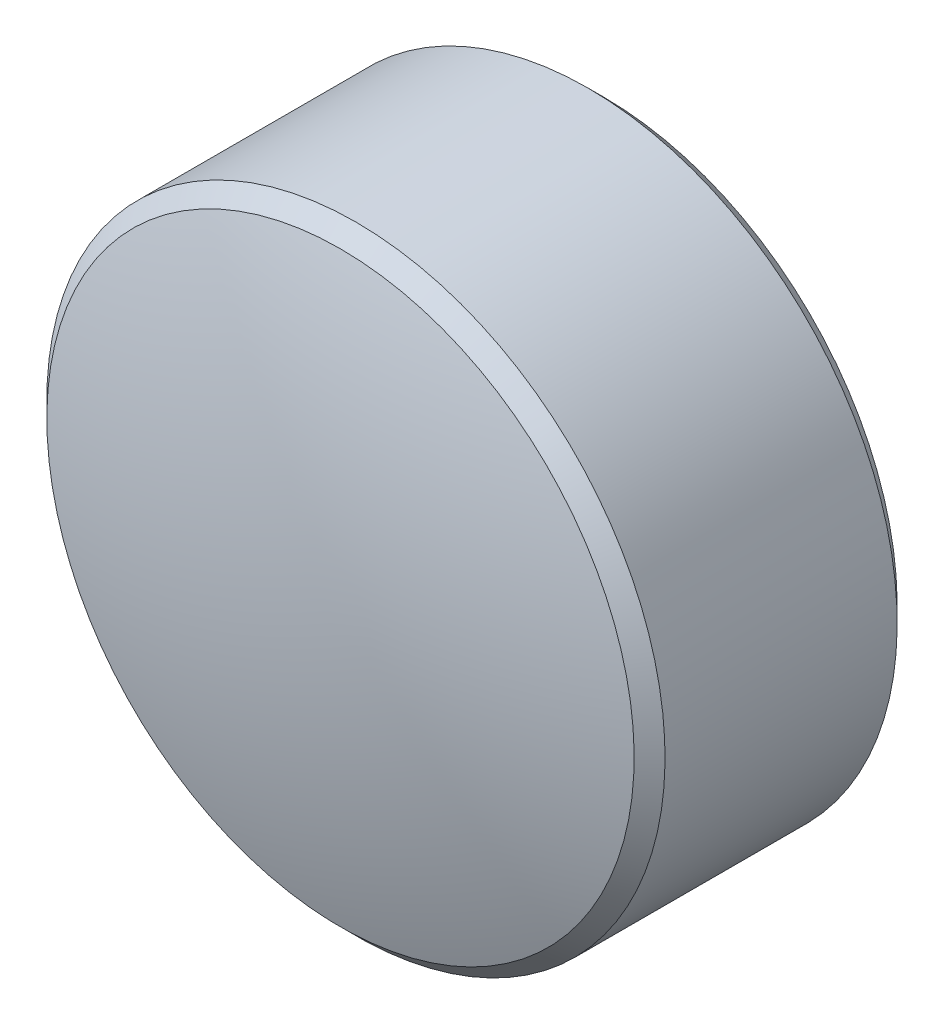
ISO-10303-21;
HEADER;
FILE_DESCRIPTION(('STEP AP214'),'2;1');
FILE_NAME('part.step','',(''),(''),'','','');
FILE_SCHEMA(('AUTOMOTIVE_DESIGN { 1 0 10303 214 1 1 1 1 }'));
ENDSEC;
DATA;
#1=APPLICATION_CONTEXT('core data for automotive mechanical design processes');
#2=APPLICATION_PROTOCOL_DEFINITION('international standard','automotive_design',2000,#1);
#3=PRODUCT_CONTEXT('',#1,'mechanical');
#4=PRODUCT('Part','Part','',(#3));
#5=PRODUCT_RELATED_PRODUCT_CATEGORY('part','',(#4));
#6=PRODUCT_DEFINITION_FORMATION('','',#4);
#7=PRODUCT_DEFINITION_CONTEXT('part definition',#1,'design');
#8=PRODUCT_DEFINITION('design','',#6,#7);
#9=PRODUCT_DEFINITION_SHAPE('','',#8);
#10=(LENGTH_UNIT() NAMED_UNIT(*) SI_UNIT(.MILLI.,.METRE.));
#11=(NAMED_UNIT(*) PLANE_ANGLE_UNIT() SI_UNIT($,.RADIAN.));
#12=(NAMED_UNIT(*) SI_UNIT($,.STERADIAN.) SOLID_ANGLE_UNIT());
#13=UNCERTAINTY_MEASURE_WITH_UNIT(LENGTH_MEASURE(1.E-05),#10,'distance_accuracy_value','');
#14=(GEOMETRIC_REPRESENTATION_CONTEXT(3) GLOBAL_UNCERTAINTY_ASSIGNED_CONTEXT((#13)) GLOBAL_UNIT_ASSIGNED_CONTEXT((#10,
#11,#12)) REPRESENTATION_CONTEXT('',''));
#15=CARTESIAN_POINT('',(0.,0.,0.));
#16=DIRECTION('',(0.,0.,1.));
#17=DIRECTION('',(1.,0.,0.));
#18=AXIS2_PLACEMENT_3D('',#15,#16,#17);
#19=CARTESIAN_POINT('',(0.630043255292849,1.16885341370505,1.0116272400795));
#20=DIRECTION('',(0.,0.,-1.));
#21=DIRECTION('',(0.,1.,0.));
#22=AXIS2_PLACEMENT_3D('',#19,#20,#21);
#23=PLANE('',#22);
#24=CARTESIAN_POINT('',(0.630043255292849,1.16885341370505,1.0116272400795));
#25=DIRECTION('',(0.,0.,-1.));
#26=DIRECTION('',(0.,1.,0.));
#27=AXIS2_PLACEMENT_3D('',#24,#25,#26);
#28=CIRCLE('',#27,0.949999999999999);
#29=CARTESIAN_POINT('',(0.630043255292849,2.11885341370505,1.0116272400795));
#30=VERTEX_POINT('',#29);
#31=EDGE_CURVE('E20',#30,#30,#28,.T.);
#32=ORIENTED_EDGE('',*,*,#31,.T.);
#33=EDGE_LOOP('',(#32));
#34=FACE_BOUND('',#33,.T.);
#35=ADVANCED_FACE('F13',(#34),#23,.T.);
#36=CARTESIAN_POINT('',(0.630043255292849,1.16885341370505,1.0116272400795));
#37=DIRECTION('',(0.,0.,-1.));
#38=DIRECTION('',(0.,1.,0.));
#39=AXIS2_PLACEMENT_3D('',#36,#37,#38);
#40=CYLINDRICAL_SURFACE('',#39,1.);
#41=CARTESIAN_POINT('',(0.630043255292849,1.16885341370505,1.0616272400795));
#42=DIRECTION('',(0.,0.,-1.));
#43=DIRECTION('',(0.,1.,0.));
#44=AXIS2_PLACEMENT_3D('',#41,#42,#43);
#45=CIRCLE('',#44,1.);
#46=CARTESIAN_POINT('',(0.630043255292849,2.16885341370505,1.0616272400795));
#47=VERTEX_POINT('',#46);
#48=EDGE_CURVE('E9',#47,#47,#45,.F.);
#49=ORIENTED_EDGE('',*,*,#48,.T.);
#50=EDGE_LOOP('',(#49));
#51=FACE_BOUND('',#50,.T.);
#52=CARTESIAN_POINT('',(0.630043255292849,1.16885341370505,1.81252510416626));
#53=DIRECTION('',(0.,0.,-1.));
#54=DIRECTION('',(0.,1.,0.));
#55=AXIS2_PLACEMENT_3D('',#52,#53,#54);
#56=CIRCLE('',#55,1.);
#57=CARTESIAN_POINT('',(0.630043255292849,2.16885341370505,1.81252510416626));
#58=VERTEX_POINT('',#57);
#59=EDGE_CURVE('E24',#58,#58,#56,.T.);
#60=ORIENTED_EDGE('',*,*,#59,.T.);
#61=EDGE_LOOP('',(#60));
#62=FACE_BOUND('',#61,.T.);
#63=ADVANCED_FACE('F46',(#51,#62),#40,.T.);
#64=CARTESIAN_POINT('',(0.630043255292849,1.16885341370505,1.81252510416626));
#65=DIRECTION('',(0.,0.,-1.));
#66=DIRECTION('',(0.,1.,0.));
#67=AXIS2_PLACEMENT_3D('',#64,#65,#66);
#68=CONICAL_SURFACE('',#67,1.,0.785398163397448);
#69=CARTESIAN_POINT('',(0.630043255292849,1.16885341370505,1.86252510416626));
#70=DIRECTION('',(0.,0.,-1.));
#71=DIRECTION('',(0.,1.,0.));
#72=AXIS2_PLACEMENT_3D('',#69,#70,#71);
#73=CIRCLE('',#72,0.95);
#74=CARTESIAN_POINT('',(0.630043255292849,2.11885341370505,1.86252510416626));
#75=VERTEX_POINT('',#74);
#76=EDGE_CURVE('E28',#75,#75,#73,.T.);
#77=ORIENTED_EDGE('',*,*,#76,.T.);
#78=EDGE_LOOP('',(#77));
#79=FACE_BOUND('',#78,.T.);
#80=ORIENTED_EDGE('',*,*,#59,.F.);
#81=EDGE_LOOP('',(#80));
#82=FACE_BOUND('',#81,.T.);
#83=ADVANCED_FACE('F34',(#79,#82),#68,.T.);
#84=CARTESIAN_POINT('',(0.630043255292849,1.16885341370505,-1.0893727599205));
#85=DIRECTION('',(0.,0.,-1.));
#86=DIRECTION('',(0.,1.,0.));
#87=AXIS2_PLACEMENT_3D('',#84,#85,#86);
#88=SPHERICAL_SURFACE('',#87,3.101);
#89=ORIENTED_EDGE('',*,*,#76,.F.);
#90=EDGE_LOOP('',(#89));
#91=FACE_BOUND('',#90,.T.);
#92=ADVANCED_FACE('F37',(#91),#88,.T.);
#93=CARTESIAN_POINT('',(0.630043255292849,1.16885341370505,1.0116272400795));
#94=DIRECTION('',(0.,0.,1.));
#95=DIRECTION('',(0.,-1.,0.));
#96=AXIS2_PLACEMENT_3D('',#93,#94,#95);
#97=CONICAL_SURFACE('',#96,0.949999999999999,0.78539816339745);
#98=ORIENTED_EDGE('',*,*,#48,.F.);
#99=EDGE_LOOP('',(#98));
#100=FACE_BOUND('',#99,.T.);
#101=ORIENTED_EDGE('',*,*,#31,.F.);
#102=EDGE_LOOP('',(#101));
#103=FACE_BOUND('',#102,.T.);
#104=ADVANCED_FACE('F15',(#100,#103),#97,.T.);
#105=CLOSED_SHELL('',(#35,#63,#83,#92,#104));
#106=MANIFOLD_SOLID_BREP('B1',#105);
#107=ADVANCED_BREP_SHAPE_REPRESENTATION('',(#18,#106),#14);
#108=SHAPE_DEFINITION_REPRESENTATION(#9,#107);
ENDSEC;
END-ISO-10303-21;
